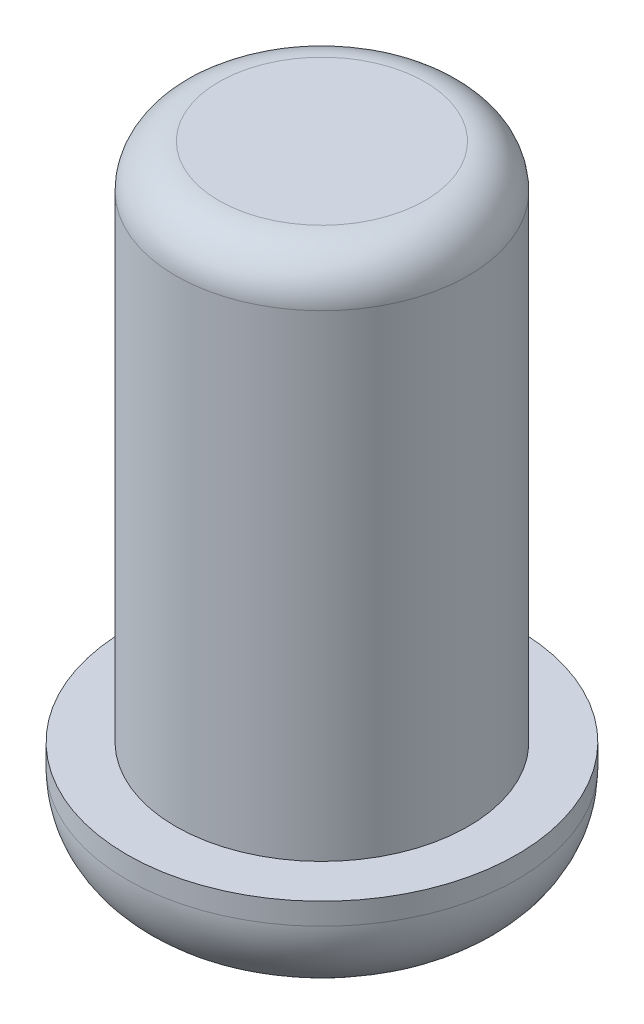
ISO-10303-21;
HEADER;
FILE_DESCRIPTION(('STEP AP214'),'2;1');
FILE_NAME('part.step','',(''),(''),'','','');
FILE_SCHEMA(('AUTOMOTIVE_DESIGN { 1 0 10303 214 1 1 1 1 }'));
ENDSEC;
DATA;
#1=APPLICATION_CONTEXT('core data for automotive mechanical design processes');
#2=APPLICATION_PROTOCOL_DEFINITION('international standard','automotive_design',2000,#1);
#3=PRODUCT_CONTEXT('',#1,'mechanical');
#4=PRODUCT('Part','Part','',(#3));
#5=PRODUCT_RELATED_PRODUCT_CATEGORY('part','',(#4));
#6=PRODUCT_DEFINITION_FORMATION('','',#4);
#7=PRODUCT_DEFINITION_CONTEXT('part definition',#1,'design');
#8=PRODUCT_DEFINITION('design','',#6,#7);
#9=PRODUCT_DEFINITION_SHAPE('','',#8);
#10=(LENGTH_UNIT() NAMED_UNIT(*) SI_UNIT(.MILLI.,.METRE.));
#11=(NAMED_UNIT(*) PLANE_ANGLE_UNIT() SI_UNIT($,.RADIAN.));
#12=(NAMED_UNIT(*) SI_UNIT($,.STERADIAN.) SOLID_ANGLE_UNIT());
#13=UNCERTAINTY_MEASURE_WITH_UNIT(LENGTH_MEASURE(1.E-05),#10,'distance_accuracy_value','');
#14=(GEOMETRIC_REPRESENTATION_CONTEXT(3) GLOBAL_UNCERTAINTY_ASSIGNED_CONTEXT((#13)) GLOBAL_UNIT_ASSIGNED_CONTEXT((#10,
#11,#12)) REPRESENTATION_CONTEXT('',''));
#15=CARTESIAN_POINT('',(0.,0.,0.));
#16=DIRECTION('',(0.,0.,1.));
#17=DIRECTION('',(1.,0.,0.));
#18=AXIS2_PLACEMENT_3D('',#15,#16,#17);
#19=CARTESIAN_POINT('',(0.,2.4,0.));
#20=DIRECTION('',(0.,-1.,0.));
#21=DIRECTION('',(0.,0.,-1.));
#22=AXIS2_PLACEMENT_3D('',#19,#20,#21);
#23=CYLINDRICAL_SURFACE('',#22,0.675);
#24=CARTESIAN_POINT('',(0.,2.2,0.));
#25=DIRECTION('',(0.,1.,0.));
#26=DIRECTION('',(0.,0.,1.));
#27=AXIS2_PLACEMENT_3D('',#24,#25,#26);
#28=CIRCLE('',#27,0.675);
#29=CARTESIAN_POINT('',(0.,2.2,0.675));
#30=VERTEX_POINT('',#29);
#31=EDGE_CURVE('E10',#30,#30,#28,.F.);
#32=ORIENTED_EDGE('',*,*,#31,.T.);
#33=EDGE_LOOP('',(#32));
#34=FACE_BOUND('',#33,.T.);
#35=CARTESIAN_POINT('',(0.,0.,0.));
#36=DIRECTION('',(0.,1.,0.));
#37=DIRECTION('',(0.,0.,1.));
#38=AXIS2_PLACEMENT_3D('',#35,#36,#37);
#39=CIRCLE('',#38,0.675);
#40=CARTESIAN_POINT('',(0.,0.,0.675));
#41=VERTEX_POINT('',#40);
#42=EDGE_CURVE('E56',#41,#41,#39,.T.);
#43=ORIENTED_EDGE('',*,*,#42,.T.);
#44=EDGE_LOOP('',(#43));
#45=FACE_BOUND('',#44,.T.);
#46=ADVANCED_FACE('F36',(#34,#45),#23,.T.);
#47=CARTESIAN_POINT('',(0.,2.4,0.));
#48=DIRECTION('',(0.,1.,0.));
#49=DIRECTION('',(0.,0.,1.));
#50=AXIS2_PLACEMENT_3D('',#47,#48,#49);
#51=PLANE('',#50);
#52=CARTESIAN_POINT('',(0.,2.4,0.));
#53=DIRECTION('',(0.,1.,0.));
#54=DIRECTION('',(0.,0.,1.));
#55=AXIS2_PLACEMENT_3D('',#52,#53,#54);
#56=CIRCLE('',#55,0.475);
#57=CARTESIAN_POINT('',(0.,2.4,0.475));
#58=VERTEX_POINT('',#57);
#59=EDGE_CURVE('E43',#58,#58,#56,.T.);
#60=ORIENTED_EDGE('',*,*,#59,.T.);
#61=EDGE_LOOP('',(#60));
#62=FACE_BOUND('',#61,.T.);
#63=ADVANCED_FACE('F68',(#62),#51,.T.);
#64=CARTESIAN_POINT('',(0.,-0.5,0.));
#65=DIRECTION('',(0.,1.,0.));
#66=DIRECTION('',(0.,0.,1.));
#67=AXIS2_PLACEMENT_3D('',#64,#65,#66);
#68=CYLINDRICAL_SURFACE('',#67,0.9);
#69=CARTESIAN_POINT('',(0.,-0.1,0.));
#70=DIRECTION('',(0.,1.,0.));
#71=DIRECTION('',(0.,0.,1.));
#72=AXIS2_PLACEMENT_3D('',#69,#70,#71);
#73=CIRCLE('',#72,0.9);
#74=CARTESIAN_POINT('',(0.,-0.1,0.9));
#75=VERTEX_POINT('',#74);
#76=EDGE_CURVE('E51',#75,#75,#73,.T.);
#77=ORIENTED_EDGE('',*,*,#76,.T.);
#78=EDGE_LOOP('',(#77));
#79=FACE_BOUND('',#78,.T.);
#80=CARTESIAN_POINT('',(0.,0.,0.));
#81=DIRECTION('',(0.,1.,0.));
#82=DIRECTION('',(0.,0.,1.));
#83=AXIS2_PLACEMENT_3D('',#80,#81,#82);
#84=CIRCLE('',#83,0.9);
#85=CARTESIAN_POINT('',(0.,0.,0.9));
#86=VERTEX_POINT('',#85);
#87=EDGE_CURVE('E59',#86,#86,#84,.T.);
#88=ORIENTED_EDGE('',*,*,#87,.F.);
#89=EDGE_LOOP('',(#88));
#90=FACE_BOUND('',#89,.T.);
#91=ADVANCED_FACE('F65',(#79,#90),#68,.T.);
#92=CARTESIAN_POINT('',(0.,-0.5,0.));
#93=DIRECTION('',(0.,1.,0.));
#94=DIRECTION('',(0.,0.,1.));
#95=AXIS2_PLACEMENT_3D('',#92,#93,#94);
#96=PLANE('',#95);
#97=CARTESIAN_POINT('',(0.,-0.5,0.));
#98=DIRECTION('',(0.,1.,0.));
#99=DIRECTION('',(0.,0.,1.));
#100=AXIS2_PLACEMENT_3D('',#97,#98,#99);
#101=CIRCLE('',#100,0.5);
#102=CARTESIAN_POINT('',(0.,-0.5,0.5));
#103=VERTEX_POINT('',#102);
#104=EDGE_CURVE('E47',#103,#103,#101,.F.);
#105=ORIENTED_EDGE('',*,*,#104,.T.);
#106=EDGE_LOOP('',(#105));
#107=FACE_BOUND('',#106,.T.);
#108=ADVANCED_FACE('F67',(#107),#96,.F.);
#109=CARTESIAN_POINT('',(0.,0.,0.));
#110=DIRECTION('',(0.,1.,0.));
#111=DIRECTION('',(0.,0.,1.));
#112=AXIS2_PLACEMENT_3D('',#109,#110,#111);
#113=PLANE('',#112);
#114=ORIENTED_EDGE('',*,*,#42,.F.);
#115=EDGE_LOOP('',(#114));
#116=FACE_BOUND('',#115,.T.);
#117=ORIENTED_EDGE('',*,*,#87,.T.);
#118=EDGE_LOOP('',(#117));
#119=FACE_BOUND('',#118,.T.);
#120=ADVANCED_FACE('F63',(#116,#119),#113,.T.);
#121=CARTESIAN_POINT('',(0.,-0.1,0.));
#122=DIRECTION('',(0.,1.,0.));
#123=DIRECTION('',(0.,0.,1.));
#124=AXIS2_PLACEMENT_3D('',#121,#122,#123);
#125=TOROIDAL_SURFACE('',#124,0.5,0.4);
#126=ORIENTED_EDGE('',*,*,#104,.F.);
#127=EDGE_LOOP('',(#126));
#128=FACE_BOUND('',#127,.T.);
#129=ORIENTED_EDGE('',*,*,#76,.F.);
#130=EDGE_LOOP('',(#129));
#131=FACE_BOUND('',#130,.T.);
#132=ADVANCED_FACE('F84',(#128,#131),#125,.T.);
#133=CARTESIAN_POINT('',(0.,2.2,0.));
#134=DIRECTION('',(0.,1.,0.));
#135=DIRECTION('',(0.,0.,1.));
#136=AXIS2_PLACEMENT_3D('',#133,#134,#135);
#137=TOROIDAL_SURFACE('',#136,0.475,0.2);
#138=ORIENTED_EDGE('',*,*,#31,.F.);
#139=EDGE_LOOP('',(#138));
#140=FACE_BOUND('',#139,.T.);
#141=ORIENTED_EDGE('',*,*,#59,.F.);
#142=EDGE_LOOP('',(#141));
#143=FACE_BOUND('',#142,.T.);
#144=ADVANCED_FACE('F38',(#140,#143),#137,.T.);
#145=CLOSED_SHELL('',(#46,#63,#91,#108,#120,#132,#144));
#146=MANIFOLD_SOLID_BREP('B2',#145);
#147=ADVANCED_BREP_SHAPE_REPRESENTATION('',(#18,#146),#14);
#148=SHAPE_DEFINITION_REPRESENTATION(#9,#147);
ENDSEC;
END-ISO-10303-21;
